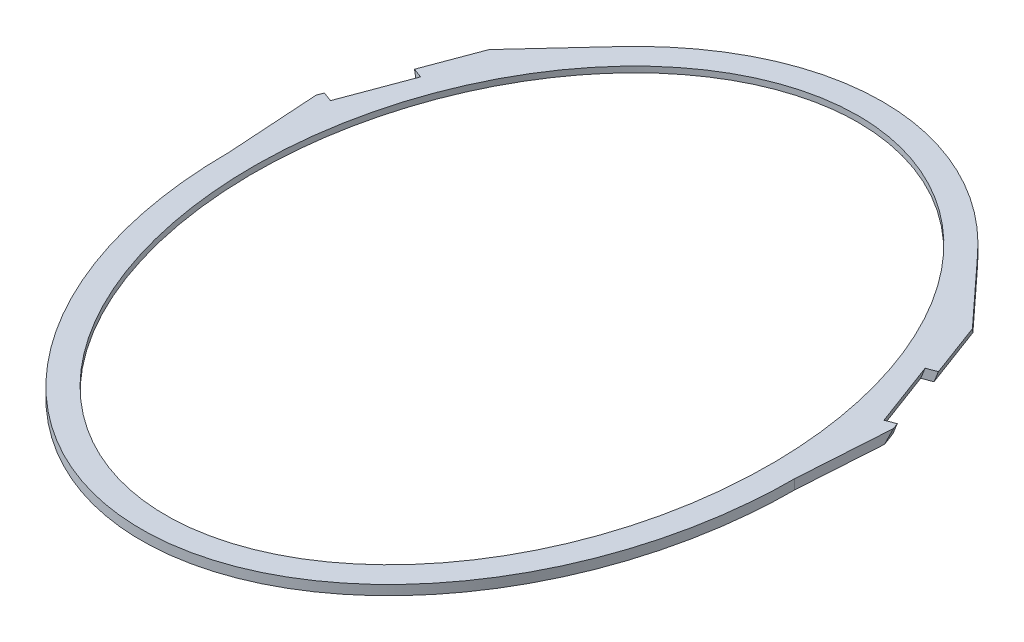
ISO-10303-21;
HEADER;
FILE_DESCRIPTION(('STEP AP214'),'2;1');
FILE_NAME('part.step','',(''),(''),'','','');
FILE_SCHEMA(('AUTOMOTIVE_DESIGN { 1 0 10303 214 1 1 1 1 }'));
ENDSEC;
DATA;
#1=APPLICATION_CONTEXT('core data for automotive mechanical design processes');
#2=APPLICATION_PROTOCOL_DEFINITION('international standard','automotive_design',2000,#1);
#3=PRODUCT_CONTEXT('',#1,'mechanical');
#4=PRODUCT('Part','Part','',(#3));
#5=PRODUCT_RELATED_PRODUCT_CATEGORY('part','',(#4));
#6=PRODUCT_DEFINITION_FORMATION('','',#4);
#7=PRODUCT_DEFINITION_CONTEXT('part definition',#1,'design');
#8=PRODUCT_DEFINITION('design','',#6,#7);
#9=PRODUCT_DEFINITION_SHAPE('','',#8);
#10=(LENGTH_UNIT() NAMED_UNIT(*) SI_UNIT(.MILLI.,.METRE.));
#11=(NAMED_UNIT(*) PLANE_ANGLE_UNIT() SI_UNIT($,.RADIAN.));
#12=(NAMED_UNIT(*) SI_UNIT($,.STERADIAN.) SOLID_ANGLE_UNIT());
#13=UNCERTAINTY_MEASURE_WITH_UNIT(LENGTH_MEASURE(1.E-05),#10,'distance_accuracy_value','');
#14=(GEOMETRIC_REPRESENTATION_CONTEXT(3) GLOBAL_UNCERTAINTY_ASSIGNED_CONTEXT((#13)) GLOBAL_UNIT_ASSIGNED_CONTEXT((#10,
#11,#12)) REPRESENTATION_CONTEXT('',''));
#15=CARTESIAN_POINT('',(0.,0.,0.));
#16=DIRECTION('',(0.,0.,1.));
#17=DIRECTION('',(1.,0.,0.));
#18=AXIS2_PLACEMENT_3D('',#15,#16,#17);
#19=CARTESIAN_POINT('',(0.,10.,0.));
#20=DIRECTION('',(0.,1.,0.));
#21=DIRECTION('',(0.,0.,1.));
#22=AXIS2_PLACEMENT_3D('',#19,#20,#21);
#23=PLANE('',#22);
#24=CARTESIAN_POINT('',(0.,10.,0.));
#25=DIRECTION('',(0.,1.,0.));
#26=DIRECTION('',(0.,0.,-1.));
#27=AXIS2_PLACEMENT_3D('',#24,#25,#26);
#28=ELLIPSE('',#27,355.,265.);
#29=CARTESIAN_POINT('',(0.,10.,-355.));
#30=VERTEX_POINT('',#29);
#31=EDGE_CURVE('E282',#30,#30,#28,.T.);
#32=ORIENTED_EDGE('',*,*,#31,.F.);
#33=EDGE_LOOP('',(#32));
#34=FACE_BOUND('',#33,.T.);
#35=DIRECTION('',(-0.349563318607243,0.,-0.936912742086631));
#36=VECTOR('',#35,1.);
#37=CARTESIAN_POINT('',(291.101893060147,10.,-108.61048123257));
#38=LINE('',#37,#36);
#39=CARTESIAN_POINT('',(296.124645377917,10.,-95.1483117303062));
#40=VERTEX_POINT('',#39);
#41=CARTESIAN_POINT('',(293.778239365161,9.99999999999999,-101.437237296694));
#42=VERTEX_POINT('',#41);
#43=EDGE_CURVE('E188',#40,#42,#38,.T.);
#44=ORIENTED_EDGE('',*,*,#43,.T.);
#45=DIRECTION('',(-0.936912742086632,0.,0.349563318607242));
#46=VECTOR('',#45,1.);
#47=CARTESIAN_POINT('',(2.67634630501397,10.,7.17324393587594));
#48=LINE('',#47,#46);
#49=CARTESIAN_POINT('',(283.853177648386,10.,-97.7341843278863));
#50=VERTEX_POINT('',#49);
#51=EDGE_CURVE('E335',#42,#50,#48,.T.);
#52=ORIENTED_EDGE('',*,*,#51,.T.);
#53=DIRECTION('',(0.349563318607243,0.,0.936912742086632));
#54=VECTOR('',#53,1.);
#55=CARTESIAN_POINT('',(281.176831343372,10.,-104.907428263763));
#56=LINE('',#55,#54);
#57=CARTESIAN_POINT('',(258.745192327603,10.,-165.02955006847));
#58=VERTEX_POINT('',#57);
#59=EDGE_CURVE('E183',#58,#50,#56,.T.);
#60=ORIENTED_EDGE('',*,*,#59,.F.);
#61=DIRECTION('',(0.936912742086631,0.,-0.349563318607245));
#62=VECTOR('',#61,1.);
#63=CARTESIAN_POINT('',(-22.4316390157697,10.,-60.1221218047065));
#64=LINE('',#63,#62);
#65=CARTESIAN_POINT('',(268.670254044377,10.,-168.732603037277));
#66=VERTEX_POINT('',#65);
#67=EDGE_CURVE('E173',#58,#66,#64,.T.);
#68=ORIENTED_EDGE('',*,*,#67,.T.);
#69=CARTESIAN_POINT('',(247.929891726637,10.,-224.321701482749));
#70=VERTEX_POINT('',#69);
#71=EDGE_CURVE('E181',#66,#70,#38,.T.);
#72=ORIENTED_EDGE('',*,*,#71,.T.);
#73=DIRECTION('',(-0.677985688036719,0.,-0.735075102841456));
#74=VECTOR('',#73,1.);
#75=CARTESIAN_POINT('',(235.398823471506,10.,-237.907941500628));
#76=LINE('',#75,#74);
#77=CARTESIAN_POINT('',(188.989530621689,10.,-288.225103523863));
#78=VERTEX_POINT('',#77);
#79=EDGE_CURVE('E198',#70,#78,#76,.T.);
#80=ORIENTED_EDGE('',*,*,#79,.T.);
#81=CARTESIAN_POINT('',(0.,10.,0.));
#82=DIRECTION('',(0.,1.,0.));
#83=DIRECTION('',(0.,0.,-1.));
#84=AXIS2_PLACEMENT_3D('',#81,#82,#83);
#85=ELLIPSE('',#84,380.,290.);
#86=CARTESIAN_POINT('',(-188.989530621689,10.,-288.225103523863));
#87=VERTEX_POINT('',#86);
#88=EDGE_CURVE('E310',#78,#87,#85,.T.);
#89=ORIENTED_EDGE('',*,*,#88,.T.);
#90=DIRECTION('',(0.677985688036719,0.,-0.735075102841456));
#91=VECTOR('',#90,1.);
#92=CARTESIAN_POINT('',(-241.664357599072,10.,-231.114821491688));
#93=LINE('',#92,#91);
#94=CARTESIAN_POINT('',(-247.929891726637,10.,-224.321701482749));
#95=VERTEX_POINT('',#94);
#96=EDGE_CURVE('E252',#95,#87,#93,.T.);
#97=ORIENTED_EDGE('',*,*,#96,.F.);
#98=DIRECTION('',(-0.349563318607243,0.,0.936912742086631));
#99=VECTOR('',#98,1.);
#100=CARTESIAN_POINT('',(-291.101893060147,10.,-108.61048123257));
#101=LINE('',#100,#99);
#102=CARTESIAN_POINT('',(-268.670254044377,9.99999999999997,-168.732603037277));
#103=VERTEX_POINT('',#102);
#104=EDGE_CURVE('E242',#95,#103,#101,.T.);
#105=ORIENTED_EDGE('',*,*,#104,.T.);
#106=DIRECTION('',(-0.936912742086631,0.,-0.349563318607245));
#107=VECTOR('',#106,1.);
#108=CARTESIAN_POINT('',(22.4316390157697,10.,-60.1221218047065));
#109=LINE('',#108,#107);
#110=CARTESIAN_POINT('',(-258.745192327603,10.,-165.02955006847));
#111=VERTEX_POINT('',#110);
#112=EDGE_CURVE('E233',#111,#103,#109,.T.);
#113=ORIENTED_EDGE('',*,*,#112,.F.);
#114=DIRECTION('',(0.349563318607243,0.,-0.936912742086632));
#115=VECTOR('',#114,1.);
#116=CARTESIAN_POINT('',(-281.176831343372,10.,-104.907428263763));
#117=LINE('',#116,#115);
#118=CARTESIAN_POINT('',(-283.853177648386,10.,-97.7341843278863));
#119=VERTEX_POINT('',#118);
#120=EDGE_CURVE('E235',#119,#111,#117,.T.);
#121=ORIENTED_EDGE('',*,*,#120,.F.);
#122=DIRECTION('',(0.936912742086631,0.,0.349563318607245));
#123=VECTOR('',#122,1.);
#124=CARTESIAN_POINT('',(-2.67634630501433,10.,7.17324393587681));
#125=LINE('',#124,#123);
#126=CARTESIAN_POINT('',(-293.778239365161,9.99999999999997,-101.437237296694));
#127=VERTEX_POINT('',#126);
#128=EDGE_CURVE('E228',#127,#119,#125,.T.);
#129=ORIENTED_EDGE('',*,*,#128,.F.);
#130=CARTESIAN_POINT('',(-296.124645377917,10.,-95.148311730306));
#131=VERTEX_POINT('',#130);
#132=EDGE_CURVE('E241',#127,#131,#101,.T.);
#133=ORIENTED_EDGE('',*,*,#132,.T.);
#134=DIRECTION('',(-0.0642365171820711,0.,-0.997934702202663));
#135=VECTOR('',#134,1.);
#136=CARTESIAN_POINT('',(-290.,10.,0.));
#137=LINE('',#136,#135);
#138=CARTESIAN_POINT('',(-290.,10.,0.));
#139=VERTEX_POINT('',#138);
#140=EDGE_CURVE('E249',#139,#131,#137,.T.);
#141=ORIENTED_EDGE('',*,*,#140,.F.);
#142=CARTESIAN_POINT('',(290.,10.,0.));
#143=VERTEX_POINT('',#142);
#144=EDGE_CURVE('E305',#139,#143,#85,.T.);
#145=ORIENTED_EDGE('',*,*,#144,.T.);
#146=DIRECTION('',(0.0642365171820711,0.,-0.997934702202663));
#147=VECTOR('',#146,1.);
#148=CARTESIAN_POINT('',(295.575664034813,10.,-86.6197121551897));
#149=LINE('',#148,#147);
#150=EDGE_CURVE('E200',#143,#40,#149,.T.);
#151=ORIENTED_EDGE('',*,*,#150,.T.);
#152=EDGE_LOOP('',(#44,#52,#60,#68,#72,#80,#89,#97,#105,#113,#121,#129,#133,#141,#145,#151));
#153=FACE_BOUND('',#152,.T.);
#154=ADVANCED_FACE('F33',(#34,#153),#23,.T.);
#155=CARTESIAN_POINT('',(0.,0.,0.));
#156=DIRECTION('',(0.,1.,0.));
#157=DIRECTION('',(0.,0.,1.));
#158=AXIS2_PLACEMENT_3D('',#155,#156,#157);
#159=PLANE('',#158);
#160=CARTESIAN_POINT('',(0.,0.,0.));
#161=DIRECTION('',(0.,-1.,0.));
#162=DIRECTION('',(0.,0.,1.));
#163=AXIS2_PLACEMENT_3D('',#160,#161,#162);
#164=ELLIPSE('',#163,365.,275.);
#165=CARTESIAN_POINT('',(243.259040827739,0.,-170.232954756121));
#166=VERTEX_POINT('',#165);
#167=CARTESIAN_POINT('',(-243.259040827739,0.,-170.232954756121));
#168=VERTEX_POINT('',#167);
#169=EDGE_CURVE('E277',#166,#168,#164,.T.);
#170=ORIENTED_EDGE('',*,*,#169,.F.);
#171=DIRECTION('',(0.417861896408862,0.,0.908510558843203));
#172=VECTOR('',#171,1.);
#173=CARTESIAN_POINT('',(188.989530621689,0.,-288.225103523863));
#174=LINE('',#173,#172);
#175=CARTESIAN_POINT('',(225.25265776127,0.,-209.382226999064));
#176=VERTEX_POINT('',#175);
#177=EDGE_CURVE('E197',#176,#166,#174,.T.);
#178=ORIENTED_EDGE('',*,*,#177,.F.);
#179=CARTESIAN_POINT('',(-225.25265776127,0.,-209.382226999064));
#180=VERTEX_POINT('',#179);
#181=EDGE_CURVE('E284',#180,#176,#164,.T.);
#182=ORIENTED_EDGE('',*,*,#181,.F.);
#183=DIRECTION('',(-0.417861896408862,0.,0.908510558843203));
#184=VECTOR('',#183,1.);
#185=CARTESIAN_POINT('',(-243.259040827739,0.,-170.232954756121));
#186=LINE('',#185,#184);
#187=EDGE_CURVE('E253',#180,#168,#186,.T.);
#188=ORIENTED_EDGE('',*,*,#187,.T.);
#189=EDGE_LOOP('',(#170,#178,#182,#188));
#190=FACE_BOUND('',#189,.T.);
#191=DIRECTION('',(-0.936912742086632,0.,0.349563318607242));
#192=VECTOR('',#191,1.);
#193=CARTESIAN_POINT('',(2.67634630501396,0.,7.1732439358759));
#194=LINE('',#193,#192);
#195=CARTESIAN_POINT('',(290.503136091468,0.,-100.215292159537));
#196=VERTEX_POINT('',#195);
#197=CARTESIAN_POINT('',(280.578074374694,0.,-96.5122391907292));
#198=VERTEX_POINT('',#197);
#199=EDGE_CURVE('E184',#196,#198,#194,.T.);
#200=ORIENTED_EDGE('',*,*,#199,.F.);
#201=DIRECTION('',(-0.349563318607243,0.,-0.936912742086631));
#202=VECTOR('',#201,1.);
#203=CARTESIAN_POINT('',(287.826789786454,0.,-107.388536095413));
#204=LINE('',#203,#202);
#205=CARTESIAN_POINT('',(295.575664034813,0.,-86.6197121551898));
#206=VERTEX_POINT('',#205);
#207=EDGE_CURVE('E189',#206,#196,#204,.T.);
#208=ORIENTED_EDGE('',*,*,#207,.F.);
#209=DIRECTION('',(0.0642365171820711,0.,-0.997934702202663));
#210=VECTOR('',#209,1.);
#211=CARTESIAN_POINT('',(290.,0.,0.));
#212=LINE('',#211,#210);
#213=CARTESIAN_POINT('',(290.,0.,0.));
#214=VERTEX_POINT('',#213);
#215=EDGE_CURVE('E201',#214,#206,#212,.T.);
#216=ORIENTED_EDGE('',*,*,#215,.F.);
#217=CARTESIAN_POINT('',(0.,0.,0.));
#218=DIRECTION('',(0.,1.,0.));
#219=DIRECTION('',(0.,0.,-1.));
#220=AXIS2_PLACEMENT_3D('',#217,#218,#219);
#221=ELLIPSE('',#220,380.,290.);
#222=CARTESIAN_POINT('',(-290.,0.,0.));
#223=VERTEX_POINT('',#222);
#224=EDGE_CURVE('E311',#223,#214,#221,.T.);
#225=ORIENTED_EDGE('',*,*,#224,.F.);
#226=DIRECTION('',(-0.0642365171820711,0.,-0.997934702202663));
#227=VECTOR('',#226,1.);
#228=CARTESIAN_POINT('',(-295.575664034813,0.,-86.6197121551897));
#229=LINE('',#228,#227);
#230=CARTESIAN_POINT('',(-295.575664034813,0.,-86.6197121551899));
#231=VERTEX_POINT('',#230);
#232=EDGE_CURVE('E248',#223,#231,#229,.T.);
#233=ORIENTED_EDGE('',*,*,#232,.T.);
#234=DIRECTION('',(-0.349563318607243,0.,0.936912742086631));
#235=VECTOR('',#234,1.);
#236=CARTESIAN_POINT('',(-287.826789786454,0.,-107.388536095413));
#237=LINE('',#236,#235);
#238=CARTESIAN_POINT('',(-290.503136091468,0.,-100.215292159536));
#239=VERTEX_POINT('',#238);
#240=EDGE_CURVE('E237',#239,#231,#237,.T.);
#241=ORIENTED_EDGE('',*,*,#240,.F.);
#242=DIRECTION('',(0.936912742086631,0.,0.349563318607245));
#243=VECTOR('',#242,1.);
#244=CARTESIAN_POINT('',(-2.67634630501435,0.,7.17324393587687));
#245=LINE('',#244,#243);
#246=CARTESIAN_POINT('',(-280.578074374694,0.,-96.5122391907292));
#247=VERTEX_POINT('',#246);
#248=EDGE_CURVE('E225',#239,#247,#245,.T.);
#249=ORIENTED_EDGE('',*,*,#248,.T.);
#250=DIRECTION('',(0.349563318607243,0.,-0.936912742086632));
#251=VECTOR('',#250,1.);
#252=CARTESIAN_POINT('',(-277.90172806968,0.,-103.685483126605));
#253=LINE('',#252,#251);
#254=CARTESIAN_POINT('',(-255.47008905391,0.,-163.807604931313));
#255=VERTEX_POINT('',#254);
#256=EDGE_CURVE('E322',#247,#255,#253,.T.);
#257=ORIENTED_EDGE('',*,*,#256,.T.);
#258=DIRECTION('',(-0.936912742086631,0.,-0.349563318607245));
#259=VECTOR('',#258,1.);
#260=CARTESIAN_POINT('',(22.4316390157697,0.,-60.1221218047064));
#261=LINE('',#260,#259);
#262=CARTESIAN_POINT('',(-265.395150770685,0.,-167.51065790012));
#263=VERTEX_POINT('',#262);
#264=EDGE_CURVE('E230',#255,#263,#261,.T.);
#265=ORIENTED_EDGE('',*,*,#264,.T.);
#266=CARTESIAN_POINT('',(-241.664357599071,0.,-231.114821491688));
#267=VERTEX_POINT('',#266);
#268=EDGE_CURVE('E238',#267,#263,#237,.T.);
#269=ORIENTED_EDGE('',*,*,#268,.F.);
#270=DIRECTION('',(0.677985688036719,0.,-0.735075102841456));
#271=VECTOR('',#270,1.);
#272=CARTESIAN_POINT('',(-235.398823471506,0.,-237.907941500628));
#273=LINE('',#272,#271);
#274=CARTESIAN_POINT('',(-188.989530621689,0.,-288.225103523863));
#275=VERTEX_POINT('',#274);
#276=EDGE_CURVE('E259',#267,#275,#273,.T.);
#277=ORIENTED_EDGE('',*,*,#276,.T.);
#278=CARTESIAN_POINT('',(188.989530621689,0.,-288.225103523863));
#279=VERTEX_POINT('',#278);
#280=EDGE_CURVE('E304',#279,#275,#221,.T.);
#281=ORIENTED_EDGE('',*,*,#280,.F.);
#282=DIRECTION('',(-0.677985688036719,0.,-0.735075102841456));
#283=VECTOR('',#282,1.);
#284=CARTESIAN_POINT('',(241.664357599072,0.,-231.114821491688));
#285=LINE('',#284,#283);
#286=CARTESIAN_POINT('',(241.664357599072,0.,-231.114821491688));
#287=VERTEX_POINT('',#286);
#288=EDGE_CURVE('E206',#287,#279,#285,.T.);
#289=ORIENTED_EDGE('',*,*,#288,.F.);
#290=CARTESIAN_POINT('',(265.395150770685,0.,-167.51065790012));
#291=VERTEX_POINT('',#290);
#292=EDGE_CURVE('E56',#291,#287,#204,.T.);
#293=ORIENTED_EDGE('',*,*,#292,.F.);
#294=DIRECTION('',(0.936912742086631,0.,-0.349563318607245));
#295=VECTOR('',#294,1.);
#296=CARTESIAN_POINT('',(-22.4316390157697,0.,-60.1221218047064));
#297=LINE('',#296,#295);
#298=CARTESIAN_POINT('',(255.47008905391,0.,-163.807604931313));
#299=VERTEX_POINT('',#298);
#300=EDGE_CURVE('E49',#299,#291,#297,.T.);
#301=ORIENTED_EDGE('',*,*,#300,.F.);
#302=DIRECTION('',(0.349563318607243,0.,0.936912742086632));
#303=VECTOR('',#302,1.);
#304=CARTESIAN_POINT('',(277.90172806968,0.,-103.685483126605));
#305=LINE('',#304,#303);
#306=EDGE_CURVE('E11',#299,#198,#305,.T.);
#307=ORIENTED_EDGE('',*,*,#306,.T.);
#308=EDGE_LOOP('',(#200,#208,#216,#225,#233,#241,#249,#257,#265,#269,#277,#281,#289,#293,#301,#307));
#309=FACE_BOUND('',#308,.T.);
#310=ADVANCED_FACE('F342',(#190,#309),#159,.F.);
#311=CARTESIAN_POINT('',(189.911570389431,-48.12196624943,-321.702620238194));
#312=DIRECTION('',(0.884433277428107,-0.329983164553724,-0.32998316455372));
#313=DIRECTION('',(-0.349563318607248,-0.93691274208663,0.));
#314=AXIS2_PLACEMENT_3D('',#311,#312,#313);
#315=PLANE('',#314);
#316=ORIENTED_EDGE('',*,*,#207,.T.);
#317=DIRECTION('',(0.309165431544456,0.943986817233752,-0.115350010085916));
#318=VECTOR('',#317,1.);
#319=CARTESIAN_POINT('',(274.742695171467,-48.1219662494309,-94.3350518946437));
#320=LINE('',#319,#318);
#321=EDGE_CURVE('E42',#196,#42,#320,.T.);
#322=ORIENTED_EDGE('',*,*,#321,.T.);
#323=ORIENTED_EDGE('',*,*,#43,.F.);
#324=DIRECTION('',(-0.0417336482239323,-0.760201576030195,0.648345483833371));
#325=VECTOR('',#324,1.);
#326=CARTESIAN_POINT('',(293.539471983334,-37.0903688632449,-54.9868217423929));
#327=LINE('',#326,#325);
#328=EDGE_CURVE('E191',#40,#206,#327,.T.);
#329=ORIENTED_EDGE('',*,*,#328,.T.);
#330=EDGE_LOOP('',(#316,#322,#323,#329));
#331=FACE_BOUND('',#330,.T.);
#332=ADVANCED_FACE('F330',(#331),#315,.T.);
#333=ORIENTED_EDGE('',*,*,#71,.F.);
#334=DIRECTION('',(-0.309165431544452,-0.943986817233752,0.115350010085926));
#335=VECTOR('',#334,1.);
#336=CARTESIAN_POINT('',(249.634709850684,-48.121966249429,-161.630417635227));
#337=LINE('',#336,#335);
#338=EDGE_CURVE('E170',#66,#291,#337,.T.);
#339=ORIENTED_EDGE('',*,*,#338,.T.);
#340=ORIENTED_EDGE('',*,*,#292,.T.);
#341=DIRECTION('',(0.460149819383471,0.734414353213777,0.498896483766871));
#342=VECTOR('',#341,1.);
#343=CARTESIAN_POINT('',(245.043763918911,5.39364442206402,-227.450854107226));
#344=LINE('',#343,#342);
#345=EDGE_CURVE('E176',#287,#70,#344,.T.);
#346=ORIENTED_EDGE('',*,*,#345,.T.);
#347=EDGE_LOOP('',(#333,#339,#340,#346));
#348=FACE_BOUND('',#347,.T.);
#349=ADVANCED_FACE('F186',(#348),#315,.T.);
#350=CARTESIAN_POINT('',(290.,10.,0.));
#351=DIRECTION('',(-0.997934702202663,0.,-0.0642365171820711));
#352=DIRECTION('',(-0.0642365171820711,0.,0.997934702202663));
#353=AXIS2_PLACEMENT_3D('',#350,#351,#352);
#354=PLANE('',#353);
#355=ORIENTED_EDGE('',*,*,#328,.F.);
#356=ORIENTED_EDGE('',*,*,#150,.F.);
#357=DIRECTION('',(0.,-1.,0.));
#358=VECTOR('',#357,1.);
#359=CARTESIAN_POINT('',(290.,10.,0.));
#360=LINE('',#359,#358);
#361=EDGE_CURVE('E210',#143,#214,#360,.T.);
#362=ORIENTED_EDGE('',*,*,#361,.T.);
#363=ORIENTED_EDGE('',*,*,#215,.T.);
#364=EDGE_LOOP('',(#355,#356,#362,#363));
#365=FACE_BOUND('',#364,.T.);
#366=ADVANCED_FACE('F339',(#365),#354,.F.);
#367=CARTESIAN_POINT('',(241.664357599072,10.,-231.114821491688));
#368=DIRECTION('',(-0.735075102841456,0.,0.677985688036719));
#369=DIRECTION('',(0.677985688036719,0.,0.735075102841456));
#370=AXIS2_PLACEMENT_3D('',#367,#368,#369);
#371=PLANE('',#370);
#372=ORIENTED_EDGE('',*,*,#345,.F.);
#373=ORIENTED_EDGE('',*,*,#288,.T.);
#374=DIRECTION('',(0.,-1.,0.));
#375=VECTOR('',#374,1.);
#376=CARTESIAN_POINT('',(188.989530621689,10.,-288.225103523863));
#377=LINE('',#376,#375);
#378=EDGE_CURVE('E204',#78,#279,#377,.T.);
#379=ORIENTED_EDGE('',*,*,#378,.F.);
#380=ORIENTED_EDGE('',*,*,#79,.F.);
#381=EDGE_LOOP('',(#372,#373,#379,#380));
#382=FACE_BOUND('',#381,.T.);
#383=ADVANCED_FACE('F359',(#382),#371,.F.);
#384=DIRECTION('',(0.,-1.,0.));
#385=VECTOR('',#384,1.);
#386=SURFACE_OF_LINEAR_EXTRUSION('',#85,#385);
#387=ORIENTED_EDGE('',*,*,#361,.F.);
#388=ORIENTED_EDGE('',*,*,#144,.F.);
#389=DIRECTION('',(0.,-1.,0.));
#390=VECTOR('',#389,1.);
#391=CARTESIAN_POINT('',(-290.,10.,0.));
#392=LINE('',#391,#390);
#393=EDGE_CURVE('E256',#139,#223,#392,.T.);
#394=ORIENTED_EDGE('',*,*,#393,.T.);
#395=ORIENTED_EDGE('',*,*,#224,.T.);
#396=EDGE_LOOP('',(#387,#388,#394,#395));
#397=FACE_BOUND('',#396,.T.);
#398=ADVANCED_FACE('F35',(#397),#386,.F.);
#399=ORIENTED_EDGE('',*,*,#378,.T.);
#400=ORIENTED_EDGE('',*,*,#280,.T.);
#401=DIRECTION('',(0.,-1.,0.));
#402=VECTOR('',#401,1.);
#403=CARTESIAN_POINT('',(-188.989530621689,10.,-288.225103523863));
#404=LINE('',#403,#402);
#405=EDGE_CURVE('E264',#87,#275,#404,.T.);
#406=ORIENTED_EDGE('',*,*,#405,.F.);
#407=ORIENTED_EDGE('',*,*,#88,.F.);
#408=EDGE_LOOP('',(#399,#400,#406,#407));
#409=FACE_BOUND('',#408,.T.);
#410=ADVANCED_FACE('F292',(#409),#386,.F.);
#411=CARTESIAN_POINT('',(0.,4.,0.));
#412=DIRECTION('',(0.,-1.,0.));
#413=DIRECTION('',(0.,0.,1.));
#414=AXIS2_PLACEMENT_3D('',#411,#412,#413);
#415=ELLIPSE('',#414,365.,275.);
#416=DIRECTION('',(0.,-1.,0.));
#417=VECTOR('',#416,1.);
#418=SURFACE_OF_LINEAR_EXTRUSION('',#415,#417);
#419=DIRECTION('',(0.,-1.,0.));
#420=VECTOR('',#419,1.);
#421=CARTESIAN_POINT('',(243.259040827739,4.,-170.232954756121));
#422=LINE('',#421,#420);
#423=CARTESIAN_POINT('',(243.259040827739,4.,-170.232954756122));
#424=VERTEX_POINT('',#423);
#425=EDGE_CURVE('E217',#166,#424,#422,.F.);
#426=ORIENTED_EDGE('',*,*,#425,.F.);
#427=ORIENTED_EDGE('',*,*,#169,.T.);
#428=DIRECTION('',(0.,-1.,0.));
#429=VECTOR('',#428,1.);
#430=CARTESIAN_POINT('',(-243.259040827739,4.,-170.232954756121));
#431=LINE('',#430,#429);
#432=CARTESIAN_POINT('',(-243.259040827739,4.,-170.232954756121));
#433=VERTEX_POINT('',#432);
#434=EDGE_CURVE('E271',#168,#433,#431,.F.);
#435=ORIENTED_EDGE('',*,*,#434,.T.);
#436=EDGE_CURVE('E283',#424,#433,#415,.T.);
#437=ORIENTED_EDGE('',*,*,#436,.F.);
#438=EDGE_LOOP('',(#426,#427,#435,#437));
#439=FACE_BOUND('',#438,.T.);
#440=ADVANCED_FACE('F287',(#439),#418,.F.);
#441=DIRECTION('',(0.,-1.,0.));
#442=VECTOR('',#441,1.);
#443=CARTESIAN_POINT('',(225.252657761269,4.,-209.382226999064));
#444=LINE('',#443,#442);
#445=CARTESIAN_POINT('',(225.25265776127,4.,-209.382226999064));
#446=VERTEX_POINT('',#445);
#447=EDGE_CURVE('E213',#446,#176,#444,.T.);
#448=ORIENTED_EDGE('',*,*,#447,.F.);
#449=CARTESIAN_POINT('',(-225.25265776127,4.,-209.382226999064));
#450=VERTEX_POINT('',#449);
#451=EDGE_CURVE('E278',#450,#446,#415,.T.);
#452=ORIENTED_EDGE('',*,*,#451,.F.);
#453=DIRECTION('',(0.,-1.,0.));
#454=VECTOR('',#453,1.);
#455=CARTESIAN_POINT('',(-225.252657761269,4.,-209.382226999064));
#456=LINE('',#455,#454);
#457=EDGE_CURVE('E267',#450,#180,#456,.T.);
#458=ORIENTED_EDGE('',*,*,#457,.T.);
#459=ORIENTED_EDGE('',*,*,#181,.T.);
#460=EDGE_LOOP('',(#448,#452,#458,#459));
#461=FACE_BOUND('',#460,.T.);
#462=ADVANCED_FACE('F291',(#461),#418,.F.);
#463=CARTESIAN_POINT('',(0.,4.,0.));
#464=DIRECTION('',(0.,-1.,0.));
#465=DIRECTION('',(0.,0.,-1.));
#466=AXIS2_PLACEMENT_3D('',#463,#464,#465);
#467=PLANE('',#466);
#468=CARTESIAN_POINT('',(0.,4.,0.));
#469=DIRECTION('',(0.,-1.,0.));
#470=DIRECTION('',(0.,0.,1.));
#471=AXIS2_PLACEMENT_3D('',#468,#469,#470);
#472=ELLIPSE('',#471,355.,265.);
#473=CARTESIAN_POINT('',(0.,4.,355.));
#474=VERTEX_POINT('',#473);
#475=EDGE_CURVE('E274',#474,#474,#472,.T.);
#476=ORIENTED_EDGE('',*,*,#475,.F.);
#477=EDGE_LOOP('',(#476));
#478=FACE_BOUND('',#477,.T.);
#479=ORIENTED_EDGE('',*,*,#451,.T.);
#480=DIRECTION('',(0.417861896408862,0.,0.908510558843203));
#481=VECTOR('',#480,1.);
#482=CARTESIAN_POINT('',(265.409796635896,4.,-122.073034670043));
#483=LINE('',#482,#481);
#484=EDGE_CURVE('E325',#446,#424,#483,.T.);
#485=ORIENTED_EDGE('',*,*,#484,.T.);
#486=ORIENTED_EDGE('',*,*,#436,.T.);
#487=DIRECTION('',(-0.417861896408862,0.,0.908510558843203));
#488=VECTOR('',#487,1.);
#489=CARTESIAN_POINT('',(-265.409796635896,4.,-122.073034670043));
#490=LINE('',#489,#488);
#491=EDGE_CURVE('E309',#450,#433,#490,.T.);
#492=ORIENTED_EDGE('',*,*,#491,.F.);
#493=EDGE_LOOP('',(#479,#485,#486,#492));
#494=FACE_BOUND('',#493,.T.);
#495=ADVANCED_FACE('F294',(#478,#494),#467,.T.);
#496=CARTESIAN_POINT('',(-189.911570389431,-48.12196624943,-321.702620238194));
#497=DIRECTION('',(-0.884433277428107,-0.329983164553724,-0.32998316455372));
#498=DIRECTION('',(0.349563318607248,-0.93691274208663,0.));
#499=AXIS2_PLACEMENT_3D('',#496,#497,#498);
#500=PLANE('',#499);
#501=DIRECTION('',(0.309165431544452,-0.943986817233752,0.115350010085926));
#502=VECTOR('',#501,1.);
#503=CARTESIAN_POINT('',(-249.634709850684,-48.1219662494289,-161.630417635227));
#504=LINE('',#503,#502);
#505=EDGE_CURVE('E320',#103,#263,#504,.T.);
#506=ORIENTED_EDGE('',*,*,#505,.F.);
#507=ORIENTED_EDGE('',*,*,#104,.F.);
#508=DIRECTION('',(-0.460149819383471,0.734414353213777,0.498896483766872));
#509=VECTOR('',#508,1.);
#510=CARTESIAN_POINT('',(-242.157636111185,0.787288844128129,-230.580006731702));
#511=LINE('',#510,#509);
#512=EDGE_CURVE('E245',#267,#95,#511,.T.);
#513=ORIENTED_EDGE('',*,*,#512,.F.);
#514=ORIENTED_EDGE('',*,*,#268,.T.);
#515=EDGE_LOOP('',(#506,#507,#513,#514));
#516=FACE_BOUND('',#515,.T.);
#517=ADVANCED_FACE('F371',(#516),#500,.T.);
#518=CARTESIAN_POINT('',(-235.398823471506,10.,-237.907941500628));
#519=DIRECTION('',(-0.735075102841456,0.,-0.677985688036719));
#520=DIRECTION('',(-0.677985688036719,0.,0.735075102841456));
#521=AXIS2_PLACEMENT_3D('',#518,#519,#520);
#522=PLANE('',#521);
#523=ORIENTED_EDGE('',*,*,#276,.F.);
#524=ORIENTED_EDGE('',*,*,#512,.T.);
#525=ORIENTED_EDGE('',*,*,#96,.T.);
#526=ORIENTED_EDGE('',*,*,#405,.T.);
#527=EDGE_LOOP('',(#523,#524,#525,#526));
#528=FACE_BOUND('',#527,.T.);
#529=ADVANCED_FACE('F366',(#528),#522,.T.);
#530=CARTESIAN_POINT('',(-295.575664034813,10.,-86.6197121551897));
#531=DIRECTION('',(-0.997934702202663,0.,0.0642365171820711));
#532=DIRECTION('',(0.0642365171820711,0.,0.997934702202663));
#533=AXIS2_PLACEMENT_3D('',#530,#531,#532);
#534=PLANE('',#533);
#535=ORIENTED_EDGE('',*,*,#140,.T.);
#536=DIRECTION('',(0.0417336482239323,-0.760201576030195,0.648345483833371));
#537=VECTOR('',#536,1.);
#538=CARTESIAN_POINT('',(-295.892923886346,5.77906436198781,-91.5484447414117));
#539=LINE('',#538,#537);
#540=EDGE_CURVE('E315',#131,#231,#539,.T.);
#541=ORIENTED_EDGE('',*,*,#540,.T.);
#542=ORIENTED_EDGE('',*,*,#232,.F.);
#543=ORIENTED_EDGE('',*,*,#393,.F.);
#544=EDGE_LOOP('',(#535,#541,#542,#543));
#545=FACE_BOUND('',#544,.T.);
#546=ADVANCED_FACE('F300',(#545),#534,.T.);
#547=DIRECTION('',(0.,-1.,0.));
#548=VECTOR('',#547,1.);
#549=SURFACE_OF_LINEAR_EXTRUSION('',#28,#548);
#550=ORIENTED_EDGE('',*,*,#31,.T.);
#551=EDGE_LOOP('',(#550));
#552=FACE_BOUND('',#551,.T.);
#553=ORIENTED_EDGE('',*,*,#475,.T.);
#554=EDGE_LOOP('',(#553));
#555=FACE_BOUND('',#554,.T.);
#556=ADVANCED_FACE('F296',(#552,#555),#549,.T.);
#557=CARTESIAN_POINT('',(-243.259040827739,10.,-170.232954756121));
#558=DIRECTION('',(0.908510558843203,0.,0.417861896408862));
#559=DIRECTION('',(0.417861896408862,0.,-0.908510558843203));
#560=AXIS2_PLACEMENT_3D('',#557,#558,#559);
#561=PLANE('',#560);
#562=ORIENTED_EDGE('',*,*,#434,.F.);
#563=ORIENTED_EDGE('',*,*,#187,.F.);
#564=ORIENTED_EDGE('',*,*,#457,.F.);
#565=ORIENTED_EDGE('',*,*,#491,.T.);
#566=EDGE_LOOP('',(#562,#563,#564,#565));
#567=FACE_BOUND('',#566,.T.);
#568=ADVANCED_FACE('F299',(#567),#561,.T.);
#569=DIRECTION('',(-0.309165431544452,0.943986817233752,-0.115350010085925));
#570=VECTOR('',#569,1.);
#571=CARTESIAN_POINT('',(-274.742695171468,-48.1219662494287,-94.3350518946434));
#572=LINE('',#571,#570);
#573=EDGE_CURVE('E318',#239,#127,#572,.T.);
#574=ORIENTED_EDGE('',*,*,#573,.F.);
#575=ORIENTED_EDGE('',*,*,#240,.T.);
#576=ORIENTED_EDGE('',*,*,#540,.F.);
#577=ORIENTED_EDGE('',*,*,#132,.F.);
#578=EDGE_LOOP('',(#574,#575,#576,#577));
#579=FACE_BOUND('',#578,.T.);
#580=ADVANCED_FACE('F387',(#579),#500,.T.);
#581=CARTESIAN_POINT('',(-278.383700043495,-6.70016835446282,-95.6935153768422));
#582=DIRECTION('',(0.884433277428108,0.329983164553722,0.32998316455372));
#583=DIRECTION('',(-0.349563318607245,0.936912742086631,0.));
#584=AXIS2_PLACEMENT_3D('',#581,#582,#583);
#585=PLANE('',#584);
#586=ORIENTED_EDGE('',*,*,#120,.T.);
#587=DIRECTION('',(0.30916543154445,-0.943986817233753,0.115350010085925));
#588=VECTOR('',#587,1.);
#589=CARTESIAN_POINT('',(-259.825921270096,13.2998316455372,-165.43277139174));
#590=LINE('',#589,#588);
#591=EDGE_CURVE('E222',#111,#255,#590,.T.);
#592=ORIENTED_EDGE('',*,*,#591,.T.);
#593=ORIENTED_EDGE('',*,*,#256,.F.);
#594=DIRECTION('',(-0.309165431544451,0.943986817233753,-0.115350010085921));
#595=VECTOR('',#594,1.);
#596=CARTESIAN_POINT('',(-281.658803317187,3.29983164553724,-96.9154605139993));
#597=LINE('',#596,#595);
#598=EDGE_CURVE('E219',#247,#119,#597,.T.);
#599=ORIENTED_EDGE('',*,*,#598,.T.);
#600=EDGE_LOOP('',(#586,#592,#593,#599));
#601=FACE_BOUND('',#600,.T.);
#602=ADVANCED_FACE('F379',(#601),#585,.F.);
#603=CARTESIAN_POINT('',(-253.275714722711,-6.70016835446279,-162.988881117426));
#604=DIRECTION('',(0.349563318607245,0.,-0.936912742086631));
#605=DIRECTION('',(-0.936912742086631,0.,-0.349563318607245));
#606=AXIS2_PLACEMENT_3D('',#603,#604,#605);
#607=PLANE('',#606);
#608=ORIENTED_EDGE('',*,*,#112,.T.);
#609=ORIENTED_EDGE('',*,*,#505,.T.);
#610=ORIENTED_EDGE('',*,*,#264,.F.);
#611=ORIENTED_EDGE('',*,*,#591,.F.);
#612=EDGE_LOOP('',(#608,#609,#610,#611));
#613=FACE_BOUND('',#612,.T.);
#614=ADVANCED_FACE('F374',(#613),#607,.F.);
#615=CARTESIAN_POINT('',(-287.667887214699,21.647600846527,-99.1574572492824));
#616=DIRECTION('',(-0.349563318607245,0.,0.936912742086631));
#617=DIRECTION('',(0.936912742086631,0.,0.349563318607245));
#618=AXIS2_PLACEMENT_3D('',#615,#616,#617);
#619=PLANE('',#618);
#620=ORIENTED_EDGE('',*,*,#128,.T.);
#621=ORIENTED_EDGE('',*,*,#598,.F.);
#622=ORIENTED_EDGE('',*,*,#248,.F.);
#623=ORIENTED_EDGE('',*,*,#573,.T.);
#624=EDGE_LOOP('',(#620,#621,#622,#623));
#625=FACE_BOUND('',#624,.T.);
#626=ADVANCED_FACE('F381',(#625),#619,.F.);
#627=CARTESIAN_POINT('',(188.989530621689,10.,-288.225103523863));
#628=DIRECTION('',(0.908510558843203,0.,-0.417861896408862));
#629=DIRECTION('',(-0.417861896408862,0.,-0.908510558843203));
#630=AXIS2_PLACEMENT_3D('',#627,#628,#629);
#631=PLANE('',#630);
#632=ORIENTED_EDGE('',*,*,#177,.T.);
#633=ORIENTED_EDGE('',*,*,#425,.T.);
#634=ORIENTED_EDGE('',*,*,#484,.F.);
#635=ORIENTED_EDGE('',*,*,#447,.T.);
#636=EDGE_LOOP('',(#632,#633,#634,#635));
#637=FACE_BOUND('',#636,.T.);
#638=ADVANCED_FACE('F426',(#637),#631,.F.);
#639=CARTESIAN_POINT('',(278.383700043495,-6.70016835446282,-95.6935153768422));
#640=DIRECTION('',(-0.884433277428108,0.329983164553722,0.32998316455372));
#641=DIRECTION('',(0.349563318607245,0.936912742086631,0.));
#642=AXIS2_PLACEMENT_3D('',#639,#640,#641);
#643=PLANE('',#642);
#644=ORIENTED_EDGE('',*,*,#59,.T.);
#645=DIRECTION('',(0.309165431544451,0.943986817233753,-0.115350010085921));
#646=VECTOR('',#645,1.);
#647=CARTESIAN_POINT('',(281.658803317187,3.29983164553724,-96.9154605139993));
#648=LINE('',#647,#646);
#649=EDGE_CURVE('E350',#198,#50,#648,.T.);
#650=ORIENTED_EDGE('',*,*,#649,.F.);
#651=ORIENTED_EDGE('',*,*,#306,.F.);
#652=DIRECTION('',(-0.309165431544452,-0.943986817233752,0.115350010085926));
#653=VECTOR('',#652,1.);
#654=CARTESIAN_POINT('',(253.275714722711,-6.70016835446279,-162.988881117426));
#655=LINE('',#654,#653);
#656=EDGE_CURVE('E351',#58,#299,#655,.T.);
#657=ORIENTED_EDGE('',*,*,#656,.F.);
#658=EDGE_LOOP('',(#644,#650,#651,#657));
#659=FACE_BOUND('',#658,.T.);
#660=ADVANCED_FACE('F349',(#659),#643,.F.);
#661=CARTESIAN_POINT('',(281.658803317187,3.29983164553724,-96.9154605139993));
#662=DIRECTION('',(-0.349563318607242,0.,-0.936912742086632));
#663=DIRECTION('',(-0.936912742086632,0.,0.349563318607242));
#664=AXIS2_PLACEMENT_3D('',#661,#662,#663);
#665=PLANE('',#664);
#666=ORIENTED_EDGE('',*,*,#321,.F.);
#667=ORIENTED_EDGE('',*,*,#199,.T.);
#668=ORIENTED_EDGE('',*,*,#649,.T.);
#669=ORIENTED_EDGE('',*,*,#51,.F.);
#670=EDGE_LOOP('',(#666,#667,#668,#669));
#671=FACE_BOUND('',#670,.T.);
#672=ADVANCED_FACE('F352',(#671),#665,.T.);
#673=CARTESIAN_POINT('',(259.825921270096,13.2998316455372,-165.43277139174));
#674=DIRECTION('',(0.349563318607245,0.,0.936912742086631));
#675=DIRECTION('',(0.936912742086631,0.,-0.349563318607245));
#676=AXIS2_PLACEMENT_3D('',#673,#674,#675);
#677=PLANE('',#676);
#678=ORIENTED_EDGE('',*,*,#656,.T.);
#679=ORIENTED_EDGE('',*,*,#300,.T.);
#680=ORIENTED_EDGE('',*,*,#338,.F.);
#681=ORIENTED_EDGE('',*,*,#67,.F.);
#682=EDGE_LOOP('',(#678,#679,#680,#681));
#683=FACE_BOUND('',#682,.T.);
#684=ADVANCED_FACE('F172',(#683),#677,.T.);
#685=CLOSED_SHELL('',(#154,#310,#332,#349,#366,#383,#398,#410,#440,#462,#495,#517,#529,#546,
#556,#568,#580,#602,#614,#626,#638,#660,#672,#684));
#686=MANIFOLD_SOLID_BREP('B2',#685);
#687=ADVANCED_BREP_SHAPE_REPRESENTATION('',(#18,#686),#14);
#688=SHAPE_DEFINITION_REPRESENTATION(#9,#687);
ENDSEC;
END-ISO-10303-21;
